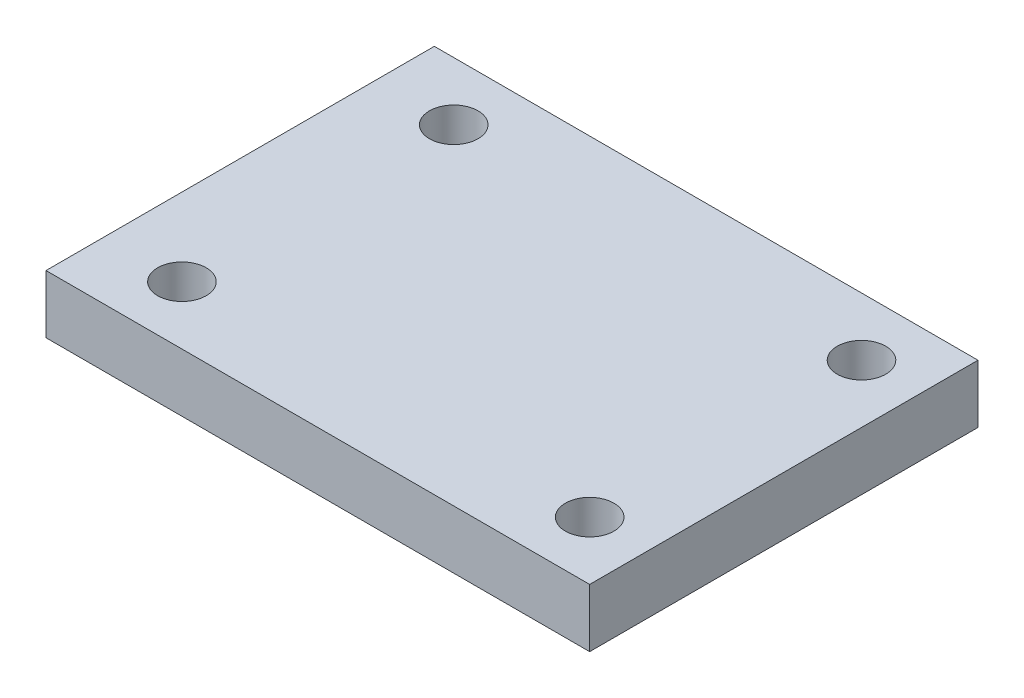
ISO-10303-21;
HEADER;
FILE_DESCRIPTION(('STEP AP214'),'2;1');
FILE_NAME('part.step','',(''),(''),'','','');
FILE_SCHEMA(('AUTOMOTIVE_DESIGN { 1 0 10303 214 1 1 1 1 }'));
ENDSEC;
DATA;
#1=APPLICATION_CONTEXT('core data for automotive mechanical design processes');
#2=APPLICATION_PROTOCOL_DEFINITION('international standard','automotive_design',2000,#1);
#3=PRODUCT_CONTEXT('',#1,'mechanical');
#4=PRODUCT('Part','Part','',(#3));
#5=PRODUCT_RELATED_PRODUCT_CATEGORY('part','',(#4));
#6=PRODUCT_DEFINITION_FORMATION('','',#4);
#7=PRODUCT_DEFINITION_CONTEXT('part definition',#1,'design');
#8=PRODUCT_DEFINITION('design','',#6,#7);
#9=PRODUCT_DEFINITION_SHAPE('','',#8);
#10=(LENGTH_UNIT() NAMED_UNIT(*) SI_UNIT(.MILLI.,.METRE.));
#11=(NAMED_UNIT(*) PLANE_ANGLE_UNIT() SI_UNIT($,.RADIAN.));
#12=(NAMED_UNIT(*) SI_UNIT($,.STERADIAN.) SOLID_ANGLE_UNIT());
#13=UNCERTAINTY_MEASURE_WITH_UNIT(LENGTH_MEASURE(1.E-05),#10,'distance_accuracy_value','');
#14=(GEOMETRIC_REPRESENTATION_CONTEXT(3) GLOBAL_UNCERTAINTY_ASSIGNED_CONTEXT((#13)) GLOBAL_UNIT_ASSIGNED_CONTEXT((#10,
#11,#12)) REPRESENTATION_CONTEXT('',''));
#15=CARTESIAN_POINT('',(0.,0.,0.));
#16=DIRECTION('',(0.,0.,1.));
#17=DIRECTION('',(1.,0.,0.));
#18=AXIS2_PLACEMENT_3D('',#15,#16,#17);
#19=CARTESIAN_POINT('',(-14.,3.,0.));
#20=DIRECTION('',(-1.,0.,0.));
#21=DIRECTION('',(0.,0.,1.));
#22=AXIS2_PLACEMENT_3D('',#19,#20,#21);
#23=PLANE('',#22);
#24=DIRECTION('',(0.,0.,-1.));
#25=VECTOR('',#24,1.);
#26=CARTESIAN_POINT('',(-14.,0.,0.));
#27=LINE('',#26,#25);
#28=CARTESIAN_POINT('',(-14.,0.,10.));
#29=VERTEX_POINT('',#28);
#30=CARTESIAN_POINT('',(-14.,0.,-10.));
#31=VERTEX_POINT('',#30);
#32=EDGE_CURVE('E104',#29,#31,#27,.T.);
#33=ORIENTED_EDGE('',*,*,#32,.F.);
#34=DIRECTION('',(0.,-1.,0.));
#35=VECTOR('',#34,1.);
#36=CARTESIAN_POINT('',(-14.,3.,10.));
#37=LINE('',#36,#35);
#38=CARTESIAN_POINT('',(-14.,3.,10.));
#39=VERTEX_POINT('',#38);
#40=EDGE_CURVE('E11',#39,#29,#37,.T.);
#41=ORIENTED_EDGE('',*,*,#40,.F.);
#42=DIRECTION('',(0.,0.,-1.));
#43=VECTOR('',#42,1.);
#44=CARTESIAN_POINT('',(-14.,3.,0.));
#45=LINE('',#44,#43);
#46=CARTESIAN_POINT('',(-14.,3.,-10.));
#47=VERTEX_POINT('',#46);
#48=EDGE_CURVE('E97',#39,#47,#45,.T.);
#49=ORIENTED_EDGE('',*,*,#48,.T.);
#50=DIRECTION('',(0.,-1.,0.));
#51=VECTOR('',#50,1.);
#52=CARTESIAN_POINT('',(-14.,3.,-10.));
#53=LINE('',#52,#51);
#54=EDGE_CURVE('E55',#47,#31,#53,.T.);
#55=ORIENTED_EDGE('',*,*,#54,.T.);
#56=EDGE_LOOP('',(#33,#41,#49,#55));
#57=FACE_BOUND('',#56,.T.);
#58=ADVANCED_FACE('F39',(#57),#23,.T.);
#59=CARTESIAN_POINT('',(0.,3.,10.));
#60=DIRECTION('',(0.,0.,1.));
#61=DIRECTION('',(1.,0.,0.));
#62=AXIS2_PLACEMENT_3D('',#59,#60,#61);
#63=PLANE('',#62);
#64=DIRECTION('',(-1.,0.,0.));
#65=VECTOR('',#64,1.);
#66=CARTESIAN_POINT('',(0.,0.,10.));
#67=LINE('',#66,#65);
#68=CARTESIAN_POINT('',(14.,0.,10.));
#69=VERTEX_POINT('',#68);
#70=EDGE_CURVE('E87',#69,#29,#67,.T.);
#71=ORIENTED_EDGE('',*,*,#70,.F.);
#72=DIRECTION('',(0.,-1.,0.));
#73=VECTOR('',#72,1.);
#74=CARTESIAN_POINT('',(14.,3.,10.));
#75=LINE('',#74,#73);
#76=CARTESIAN_POINT('',(14.,3.,10.));
#77=VERTEX_POINT('',#76);
#78=EDGE_CURVE('E47',#77,#69,#75,.T.);
#79=ORIENTED_EDGE('',*,*,#78,.F.);
#80=DIRECTION('',(-1.,0.,0.));
#81=VECTOR('',#80,1.);
#82=CARTESIAN_POINT('',(0.,3.,10.));
#83=LINE('',#82,#81);
#84=EDGE_CURVE('E85',#77,#39,#83,.T.);
#85=ORIENTED_EDGE('',*,*,#84,.T.);
#86=ORIENTED_EDGE('',*,*,#40,.T.);
#87=EDGE_LOOP('',(#71,#79,#85,#86));
#88=FACE_BOUND('',#87,.T.);
#89=ADVANCED_FACE('F83',(#88),#63,.T.);
#90=CARTESIAN_POINT('',(14.,3.,0.));
#91=DIRECTION('',(-1.,0.,0.));
#92=DIRECTION('',(0.,0.,1.));
#93=AXIS2_PLACEMENT_3D('',#90,#91,#92);
#94=PLANE('',#93);
#95=DIRECTION('',(0.,0.,-1.));
#96=VECTOR('',#95,1.);
#97=CARTESIAN_POINT('',(14.,0.,0.));
#98=LINE('',#97,#96);
#99=CARTESIAN_POINT('',(14.,0.,-10.));
#100=VERTEX_POINT('',#99);
#101=EDGE_CURVE('E108',#69,#100,#98,.T.);
#102=ORIENTED_EDGE('',*,*,#101,.T.);
#103=DIRECTION('',(0.,-1.,0.));
#104=VECTOR('',#103,1.);
#105=CARTESIAN_POINT('',(14.,3.,-10.));
#106=LINE('',#105,#104);
#107=CARTESIAN_POINT('',(14.,3.,-10.));
#108=VERTEX_POINT('',#107);
#109=EDGE_CURVE('E69',#108,#100,#106,.T.);
#110=ORIENTED_EDGE('',*,*,#109,.F.);
#111=DIRECTION('',(0.,0.,-1.));
#112=VECTOR('',#111,1.);
#113=CARTESIAN_POINT('',(14.,3.,0.));
#114=LINE('',#113,#112);
#115=EDGE_CURVE('E90',#77,#108,#114,.T.);
#116=ORIENTED_EDGE('',*,*,#115,.F.);
#117=ORIENTED_EDGE('',*,*,#78,.T.);
#118=EDGE_LOOP('',(#102,#110,#116,#117));
#119=FACE_BOUND('',#118,.T.);
#120=ADVANCED_FACE('F91',(#119),#94,.F.);
#121=CARTESIAN_POINT('',(0.,3.,-10.));
#122=DIRECTION('',(0.,0.,-1.));
#123=DIRECTION('',(-1.,0.,0.));
#124=AXIS2_PLACEMENT_3D('',#121,#122,#123);
#125=PLANE('',#124);
#126=DIRECTION('',(1.,0.,0.));
#127=VECTOR('',#126,1.);
#128=CARTESIAN_POINT('',(0.,0.,-10.));
#129=LINE('',#128,#127);
#130=EDGE_CURVE('E99',#31,#100,#129,.T.);
#131=ORIENTED_EDGE('',*,*,#130,.F.);
#132=ORIENTED_EDGE('',*,*,#54,.F.);
#133=DIRECTION('',(1.,0.,0.));
#134=VECTOR('',#133,1.);
#135=CARTESIAN_POINT('',(0.,3.,-10.));
#136=LINE('',#135,#134);
#137=EDGE_CURVE('E94',#47,#108,#136,.T.);
#138=ORIENTED_EDGE('',*,*,#137,.T.);
#139=ORIENTED_EDGE('',*,*,#109,.T.);
#140=EDGE_LOOP('',(#131,#132,#138,#139));
#141=FACE_BOUND('',#140,.T.);
#142=ADVANCED_FACE('F115',(#141),#125,.T.);
#143=CARTESIAN_POINT('',(0.,3.,0.));
#144=DIRECTION('',(0.,1.,0.));
#145=DIRECTION('',(0.,0.,1.));
#146=AXIS2_PLACEMENT_3D('',#143,#144,#145);
#147=PLANE('',#146);
#148=CARTESIAN_POINT('',(11.,3.,-7.));
#149=DIRECTION('',(0.,-1.,0.));
#150=DIRECTION('',(0.,0.,-1.));
#151=AXIS2_PLACEMENT_3D('',#148,#149,#150);
#152=CIRCLE('',#151,1.25);
#153=CARTESIAN_POINT('',(11.,3.,-8.25));
#154=VERTEX_POINT('',#153);
#155=EDGE_CURVE('E225',#154,#154,#152,.T.);
#156=ORIENTED_EDGE('',*,*,#155,.T.);
#157=EDGE_LOOP('',(#156));
#158=FACE_BOUND('',#157,.T.);
#159=CARTESIAN_POINT('',(-10.,3.,-7.));
#160=DIRECTION('',(0.,-1.,0.));
#161=DIRECTION('',(0.,0.,-1.));
#162=AXIS2_PLACEMENT_3D('',#159,#160,#161);
#163=CIRCLE('',#162,1.25);
#164=CARTESIAN_POINT('',(-10.,3.,-8.25));
#165=VERTEX_POINT('',#164);
#166=EDGE_CURVE('E235',#165,#165,#163,.T.);
#167=ORIENTED_EDGE('',*,*,#166,.T.);
#168=EDGE_LOOP('',(#167));
#169=FACE_BOUND('',#168,.T.);
#170=CARTESIAN_POINT('',(-10.,3.,7.));
#171=DIRECTION('',(0.,-1.,0.));
#172=DIRECTION('',(0.,0.,-1.));
#173=AXIS2_PLACEMENT_3D('',#170,#171,#172);
#174=CIRCLE('',#173,1.25);
#175=CARTESIAN_POINT('',(-10.,3.,5.75));
#176=VERTEX_POINT('',#175);
#177=EDGE_CURVE('E241',#176,#176,#174,.T.);
#178=ORIENTED_EDGE('',*,*,#177,.T.);
#179=EDGE_LOOP('',(#178));
#180=FACE_BOUND('',#179,.T.);
#181=CARTESIAN_POINT('',(11.,3.,7.));
#182=DIRECTION('',(0.,-1.,0.));
#183=DIRECTION('',(0.,0.,-1.));
#184=AXIS2_PLACEMENT_3D('',#181,#182,#183);
#185=CIRCLE('',#184,1.25);
#186=CARTESIAN_POINT('',(11.,3.,5.75));
#187=VERTEX_POINT('',#186);
#188=EDGE_CURVE('E106',#187,#187,#185,.T.);
#189=ORIENTED_EDGE('',*,*,#188,.T.);
#190=EDGE_LOOP('',(#189));
#191=FACE_BOUND('',#190,.T.);
#192=ORIENTED_EDGE('',*,*,#48,.F.);
#193=ORIENTED_EDGE('',*,*,#84,.F.);
#194=ORIENTED_EDGE('',*,*,#115,.T.);
#195=ORIENTED_EDGE('',*,*,#137,.F.);
#196=EDGE_LOOP('',(#192,#193,#194,#195));
#197=FACE_BOUND('',#196,.T.);
#198=ADVANCED_FACE('F96',(#158,#169,#180,#191,#197),#147,.T.);
#199=CARTESIAN_POINT('',(0.,0.,0.));
#200=DIRECTION('',(0.,1.,0.));
#201=DIRECTION('',(0.,0.,1.));
#202=AXIS2_PLACEMENT_3D('',#199,#200,#201);
#203=PLANE('',#202);
#204=CARTESIAN_POINT('',(11.,0.,-7.));
#205=DIRECTION('',(0.,-1.,0.));
#206=DIRECTION('',(0.,0.,-1.));
#207=AXIS2_PLACEMENT_3D('',#204,#205,#206);
#208=CIRCLE('',#207,1.25);
#209=CARTESIAN_POINT('',(11.,0.,-8.25));
#210=VERTEX_POINT('',#209);
#211=EDGE_CURVE('E228',#210,#210,#208,.T.);
#212=ORIENTED_EDGE('',*,*,#211,.F.);
#213=EDGE_LOOP('',(#212));
#214=FACE_BOUND('',#213,.T.);
#215=CARTESIAN_POINT('',(-10.,0.,-7.));
#216=DIRECTION('',(0.,-1.,0.));
#217=DIRECTION('',(0.,0.,-1.));
#218=AXIS2_PLACEMENT_3D('',#215,#216,#217);
#219=CIRCLE('',#218,1.25);
#220=CARTESIAN_POINT('',(-10.,0.,-8.25));
#221=VERTEX_POINT('',#220);
#222=EDGE_CURVE('E230',#221,#221,#219,.T.);
#223=ORIENTED_EDGE('',*,*,#222,.F.);
#224=EDGE_LOOP('',(#223));
#225=FACE_BOUND('',#224,.T.);
#226=CARTESIAN_POINT('',(-10.,0.,7.));
#227=DIRECTION('',(0.,-1.,0.));
#228=DIRECTION('',(0.,0.,-1.));
#229=AXIS2_PLACEMENT_3D('',#226,#227,#228);
#230=CIRCLE('',#229,1.25);
#231=CARTESIAN_POINT('',(-10.,0.,5.75));
#232=VERTEX_POINT('',#231);
#233=EDGE_CURVE('E238',#232,#232,#230,.T.);
#234=ORIENTED_EDGE('',*,*,#233,.F.);
#235=EDGE_LOOP('',(#234));
#236=FACE_BOUND('',#235,.T.);
#237=CARTESIAN_POINT('',(11.,0.,7.));
#238=DIRECTION('',(0.,-1.,0.));
#239=DIRECTION('',(0.,0.,-1.));
#240=AXIS2_PLACEMENT_3D('',#237,#238,#239);
#241=CIRCLE('',#240,1.25);
#242=CARTESIAN_POINT('',(11.,0.,5.75));
#243=VERTEX_POINT('',#242);
#244=EDGE_CURVE('E244',#243,#243,#241,.T.);
#245=ORIENTED_EDGE('',*,*,#244,.F.);
#246=EDGE_LOOP('',(#245));
#247=FACE_BOUND('',#246,.T.);
#248=ORIENTED_EDGE('',*,*,#32,.T.);
#249=ORIENTED_EDGE('',*,*,#130,.T.);
#250=ORIENTED_EDGE('',*,*,#101,.F.);
#251=ORIENTED_EDGE('',*,*,#70,.T.);
#252=EDGE_LOOP('',(#248,#249,#250,#251));
#253=FACE_BOUND('',#252,.T.);
#254=ADVANCED_FACE('F114',(#214,#225,#236,#247,#253),#203,.F.);
#255=CARTESIAN_POINT('',(11.,0.,7.));
#256=DIRECTION('',(0.,-1.,0.));
#257=DIRECTION('',(0.,0.,-1.));
#258=AXIS2_PLACEMENT_3D('',#255,#256,#257);
#259=CYLINDRICAL_SURFACE('',#258,1.25);
#260=ORIENTED_EDGE('',*,*,#188,.F.);
#261=EDGE_LOOP('',(#260));
#262=FACE_BOUND('',#261,.T.);
#263=ORIENTED_EDGE('',*,*,#244,.T.);
#264=EDGE_LOOP('',(#263));
#265=FACE_BOUND('',#264,.T.);
#266=ADVANCED_FACE('F156',(#262,#265),#259,.F.);
#267=CARTESIAN_POINT('',(-10.,0.,7.));
#268=DIRECTION('',(0.,-1.,0.));
#269=DIRECTION('',(0.,0.,-1.));
#270=AXIS2_PLACEMENT_3D('',#267,#268,#269);
#271=CYLINDRICAL_SURFACE('',#270,1.25);
#272=ORIENTED_EDGE('',*,*,#177,.F.);
#273=EDGE_LOOP('',(#272));
#274=FACE_BOUND('',#273,.T.);
#275=ORIENTED_EDGE('',*,*,#233,.T.);
#276=EDGE_LOOP('',(#275));
#277=FACE_BOUND('',#276,.T.);
#278=ADVANCED_FACE('F169',(#274,#277),#271,.F.);
#279=CARTESIAN_POINT('',(-10.,0.,-7.));
#280=DIRECTION('',(0.,-1.,0.));
#281=DIRECTION('',(0.,0.,-1.));
#282=AXIS2_PLACEMENT_3D('',#279,#280,#281);
#283=CYLINDRICAL_SURFACE('',#282,1.25);
#284=ORIENTED_EDGE('',*,*,#166,.F.);
#285=EDGE_LOOP('',(#284));
#286=FACE_BOUND('',#285,.T.);
#287=ORIENTED_EDGE('',*,*,#222,.T.);
#288=EDGE_LOOP('',(#287));
#289=FACE_BOUND('',#288,.T.);
#290=ADVANCED_FACE('F180',(#286,#289),#283,.F.);
#291=CARTESIAN_POINT('',(11.,0.,-7.));
#292=DIRECTION('',(0.,-1.,0.));
#293=DIRECTION('',(0.,0.,-1.));
#294=AXIS2_PLACEMENT_3D('',#291,#292,#293);
#295=CYLINDRICAL_SURFACE('',#294,1.25);
#296=ORIENTED_EDGE('',*,*,#155,.F.);
#297=EDGE_LOOP('',(#296));
#298=FACE_BOUND('',#297,.T.);
#299=ORIENTED_EDGE('',*,*,#211,.T.);
#300=EDGE_LOOP('',(#299));
#301=FACE_BOUND('',#300,.T.);
#302=ADVANCED_FACE('F191',(#298,#301),#295,.F.);
#303=CLOSED_SHELL('',(#58,#89,#120,#142,#198,#254,#266,#278,#290,#302));
#304=MANIFOLD_SOLID_BREP('B2',#303);
#305=ADVANCED_BREP_SHAPE_REPRESENTATION('',(#18,#304),#14);
#306=SHAPE_DEFINITION_REPRESENTATION(#9,#305);
ENDSEC;
END-ISO-10303-21;
